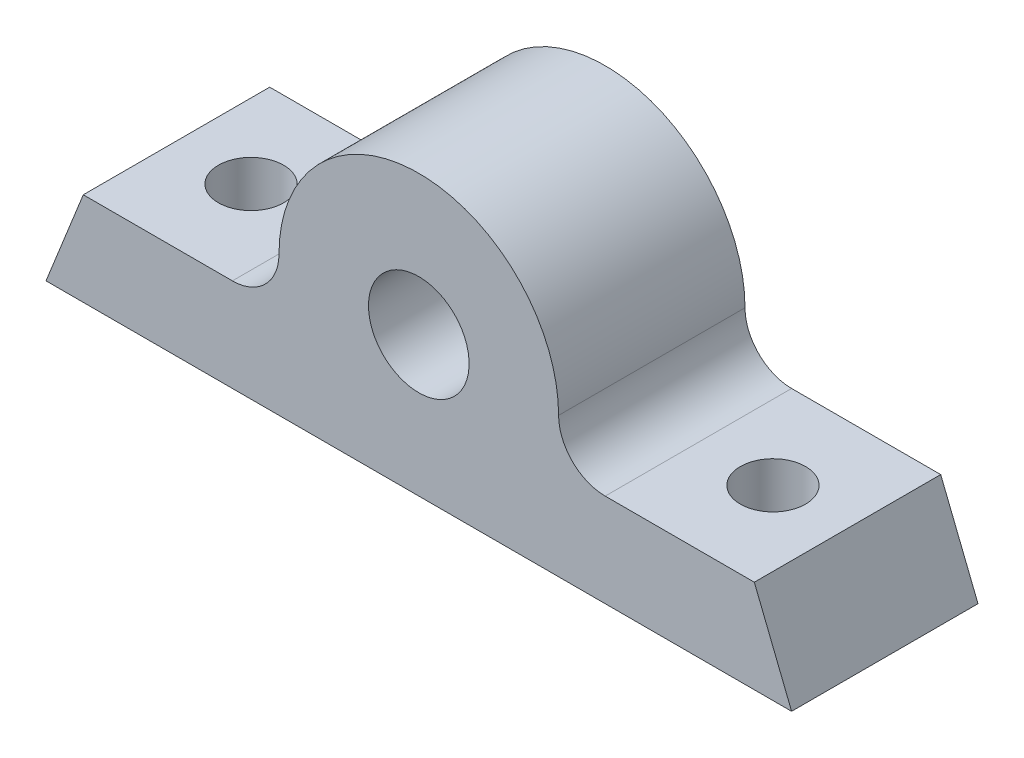
ISO-10303-21;
HEADER;
FILE_DESCRIPTION(('STEP AP214'),'2;1');
FILE_NAME('part.step','',(''),(''),'','','');
FILE_SCHEMA(('AUTOMOTIVE_DESIGN { 1 0 10303 214 1 1 1 1 }'));
ENDSEC;
DATA;
#1=APPLICATION_CONTEXT('core data for automotive mechanical design processes');
#2=APPLICATION_PROTOCOL_DEFINITION('international standard','automotive_design',2000,#1);
#3=PRODUCT_CONTEXT('',#1,'mechanical');
#4=PRODUCT('Part','Part','',(#3));
#5=PRODUCT_RELATED_PRODUCT_CATEGORY('part','',(#4));
#6=PRODUCT_DEFINITION_FORMATION('','',#4);
#7=PRODUCT_DEFINITION_CONTEXT('part definition',#1,'design');
#8=PRODUCT_DEFINITION('design','',#6,#7);
#9=PRODUCT_DEFINITION_SHAPE('','',#8);
#10=(LENGTH_UNIT() NAMED_UNIT(*) SI_UNIT(.MILLI.,.METRE.));
#11=(NAMED_UNIT(*) PLANE_ANGLE_UNIT() SI_UNIT($,.RADIAN.));
#12=(NAMED_UNIT(*) SI_UNIT($,.STERADIAN.) SOLID_ANGLE_UNIT());
#13=UNCERTAINTY_MEASURE_WITH_UNIT(LENGTH_MEASURE(1.E-05),#10,'distance_accuracy_value','');
#14=(GEOMETRIC_REPRESENTATION_CONTEXT(3) GLOBAL_UNCERTAINTY_ASSIGNED_CONTEXT((#13)) GLOBAL_UNIT_ASSIGNED_CONTEXT((#10,
#11,#12)) REPRESENTATION_CONTEXT('',''));
#15=CARTESIAN_POINT('',(0.,0.,0.));
#16=DIRECTION('',(0.,0.,1.));
#17=DIRECTION('',(1.,0.,0.));
#18=AXIS2_PLACEMENT_3D('',#15,#16,#17);
#19=CARTESIAN_POINT('',(-10.,0.,10.));
#20=DIRECTION('',(0.,0.,-1.));
#21=DIRECTION('',(-1.,0.,0.));
#22=AXIS2_PLACEMENT_3D('',#19,#20,#21);
#23=PLANE('',#22);
#24=CARTESIAN_POINT('',(-10.,0.,10.));
#25=DIRECTION('',(0.,0.,-1.));
#26=DIRECTION('',(-1.,0.,0.));
#27=AXIS2_PLACEMENT_3D('',#24,#25,#26);
#28=CIRCLE('',#27,2.5);
#29=CARTESIAN_POINT('',(-7.5,0.,10.));
#30=VERTEX_POINT('',#29);
#31=CARTESIAN_POINT('',(-10.,-2.5,10.));
#32=VERTEX_POINT('',#31);
#33=EDGE_CURVE('E145',#30,#32,#28,.T.);
#34=ORIENTED_EDGE('',*,*,#33,.T.);
#35=DIRECTION('',(-1.,0.,0.));
#36=VECTOR('',#35,1.);
#37=CARTESIAN_POINT('',(-10.,-2.5,10.));
#38=LINE('',#37,#36);
#39=CARTESIAN_POINT('',(-18.,-2.5,10.));
#40=VERTEX_POINT('',#39);
#41=EDGE_CURVE('E93',#32,#40,#38,.T.);
#42=ORIENTED_EDGE('',*,*,#41,.T.);
#43=DIRECTION('',(-0.371390676354104,-0.928476690885259,0.));
#44=VECTOR('',#43,1.);
#45=CARTESIAN_POINT('',(-18.,-2.5,10.));
#46=LINE('',#45,#44);
#47=CARTESIAN_POINT('',(-20.,-7.5,10.));
#48=VERTEX_POINT('',#47);
#49=EDGE_CURVE('E160',#40,#48,#46,.T.);
#50=ORIENTED_EDGE('',*,*,#49,.T.);
#51=DIRECTION('',(1.,0.,0.));
#52=VECTOR('',#51,1.);
#53=CARTESIAN_POINT('',(-20.,-7.5,10.));
#54=LINE('',#53,#52);
#55=CARTESIAN_POINT('',(20.,-7.5,10.));
#56=VERTEX_POINT('',#55);
#57=EDGE_CURVE('E173',#48,#56,#54,.T.);
#58=ORIENTED_EDGE('',*,*,#57,.T.);
#59=DIRECTION('',(-0.371390676354104,0.928476690885259,0.));
#60=VECTOR('',#59,1.);
#61=CARTESIAN_POINT('',(18.,-2.5,10.));
#62=LINE('',#61,#60);
#63=CARTESIAN_POINT('',(18.,-2.5,10.));
#64=VERTEX_POINT('',#63);
#65=EDGE_CURVE('E112',#56,#64,#62,.T.);
#66=ORIENTED_EDGE('',*,*,#65,.T.);
#67=DIRECTION('',(-1.,0.,0.));
#68=VECTOR('',#67,1.);
#69=CARTESIAN_POINT('',(10.,-2.5,10.));
#70=LINE('',#69,#68);
#71=CARTESIAN_POINT('',(10.,-2.5,10.));
#72=VERTEX_POINT('',#71);
#73=EDGE_CURVE('E106',#64,#72,#70,.T.);
#74=ORIENTED_EDGE('',*,*,#73,.T.);
#75=CARTESIAN_POINT('',(10.,0.,10.));
#76=DIRECTION('',(0.,0.,-1.));
#77=DIRECTION('',(1.,0.,0.));
#78=AXIS2_PLACEMENT_3D('',#75,#76,#77);
#79=CIRCLE('',#78,2.5);
#80=CARTESIAN_POINT('',(7.5,0.,10.));
#81=VERTEX_POINT('',#80);
#82=EDGE_CURVE('E110',#72,#81,#79,.T.);
#83=ORIENTED_EDGE('',*,*,#82,.T.);
#84=CARTESIAN_POINT('',(0.,0.,10.));
#85=DIRECTION('',(0.,0.,1.));
#86=DIRECTION('',(-1.,0.,0.));
#87=AXIS2_PLACEMENT_3D('',#84,#85,#86);
#88=CIRCLE('',#87,7.5);
#89=EDGE_CURVE('E50',#81,#30,#88,.T.);
#90=ORIENTED_EDGE('',*,*,#89,.T.);
#91=EDGE_LOOP('',(#34,#42,#50,#58,#66,#74,#83,#90));
#92=FACE_BOUND('',#91,.T.);
#93=CARTESIAN_POINT('',(0.,0.,10.));
#94=DIRECTION('',(0.,0.,-1.));
#95=DIRECTION('',(-1.,0.,0.));
#96=AXIS2_PLACEMENT_3D('',#93,#94,#95);
#97=CIRCLE('',#96,2.7);
#98=CARTESIAN_POINT('',(-2.7,0.,10.));
#99=VERTEX_POINT('',#98);
#100=EDGE_CURVE('E134',#99,#99,#97,.T.);
#101=ORIENTED_EDGE('',*,*,#100,.T.);
#102=EDGE_LOOP('',(#101));
#103=FACE_BOUND('',#102,.T.);
#104=ADVANCED_FACE('F33',(#92,#103),#23,.F.);
#105=CARTESIAN_POINT('',(-10.,0.,0.));
#106=DIRECTION('',(0.,0.,-1.));
#107=DIRECTION('',(-1.,0.,0.));
#108=AXIS2_PLACEMENT_3D('',#105,#106,#107);
#109=PLANE('',#108);
#110=CARTESIAN_POINT('',(-10.,0.,0.));
#111=DIRECTION('',(0.,0.,-1.));
#112=DIRECTION('',(-1.,0.,0.));
#113=AXIS2_PLACEMENT_3D('',#110,#111,#112);
#114=CIRCLE('',#113,2.5);
#115=CARTESIAN_POINT('',(-7.5,0.,0.));
#116=VERTEX_POINT('',#115);
#117=CARTESIAN_POINT('',(-10.,-2.5,0.));
#118=VERTEX_POINT('',#117);
#119=EDGE_CURVE('E130',#116,#118,#114,.T.);
#120=ORIENTED_EDGE('',*,*,#119,.F.);
#121=CARTESIAN_POINT('',(0.,0.,0.));
#122=DIRECTION('',(0.,0.,1.));
#123=DIRECTION('',(-1.,0.,0.));
#124=AXIS2_PLACEMENT_3D('',#121,#122,#123);
#125=CIRCLE('',#124,7.5);
#126=CARTESIAN_POINT('',(7.5,0.,0.));
#127=VERTEX_POINT('',#126);
#128=EDGE_CURVE('E85',#127,#116,#125,.T.);
#129=ORIENTED_EDGE('',*,*,#128,.F.);
#130=CARTESIAN_POINT('',(10.,0.,0.));
#131=DIRECTION('',(0.,0.,-1.));
#132=DIRECTION('',(1.,0.,0.));
#133=AXIS2_PLACEMENT_3D('',#130,#131,#132);
#134=CIRCLE('',#133,2.5);
#135=CARTESIAN_POINT('',(10.,-2.5,0.));
#136=VERTEX_POINT('',#135);
#137=EDGE_CURVE('E79',#136,#127,#134,.T.);
#138=ORIENTED_EDGE('',*,*,#137,.F.);
#139=DIRECTION('',(-1.,0.,0.));
#140=VECTOR('',#139,1.);
#141=CARTESIAN_POINT('',(10.,-2.5,0.));
#142=LINE('',#141,#140);
#143=CARTESIAN_POINT('',(18.,-2.5,0.));
#144=VERTEX_POINT('',#143);
#145=EDGE_CURVE('E120',#144,#136,#142,.T.);
#146=ORIENTED_EDGE('',*,*,#145,.F.);
#147=DIRECTION('',(-0.371390676354104,0.928476690885259,0.));
#148=VECTOR('',#147,1.);
#149=CARTESIAN_POINT('',(18.,-2.5,0.));
#150=LINE('',#149,#148);
#151=CARTESIAN_POINT('',(20.,-7.5,0.));
#152=VERTEX_POINT('',#151);
#153=EDGE_CURVE('E140',#152,#144,#150,.T.);
#154=ORIENTED_EDGE('',*,*,#153,.F.);
#155=DIRECTION('',(1.,0.,0.));
#156=VECTOR('',#155,1.);
#157=CARTESIAN_POINT('',(-20.,-7.5,0.));
#158=LINE('',#157,#156);
#159=CARTESIAN_POINT('',(-20.,-7.5,0.));
#160=VERTEX_POINT('',#159);
#161=EDGE_CURVE('E138',#160,#152,#158,.T.);
#162=ORIENTED_EDGE('',*,*,#161,.F.);
#163=DIRECTION('',(-0.371390676354104,-0.928476690885259,0.));
#164=VECTOR('',#163,1.);
#165=CARTESIAN_POINT('',(-18.,-2.5,0.));
#166=LINE('',#165,#164);
#167=CARTESIAN_POINT('',(-18.,-2.5,0.));
#168=VERTEX_POINT('',#167);
#169=EDGE_CURVE('E136',#168,#160,#166,.T.);
#170=ORIENTED_EDGE('',*,*,#169,.F.);
#171=DIRECTION('',(-1.,0.,0.));
#172=VECTOR('',#171,1.);
#173=CARTESIAN_POINT('',(-10.,-2.5,0.));
#174=LINE('',#173,#172);
#175=EDGE_CURVE('E133',#118,#168,#174,.T.);
#176=ORIENTED_EDGE('',*,*,#175,.F.);
#177=EDGE_LOOP('',(#120,#129,#138,#146,#154,#162,#170,#176));
#178=FACE_BOUND('',#177,.T.);
#179=CARTESIAN_POINT('',(0.,0.,0.));
#180=DIRECTION('',(0.,0.,-1.));
#181=DIRECTION('',(-1.,0.,0.));
#182=AXIS2_PLACEMENT_3D('',#179,#180,#181);
#183=CIRCLE('',#182,4.);
#184=CARTESIAN_POINT('',(-4.,0.,0.));
#185=VERTEX_POINT('',#184);
#186=EDGE_CURVE('E190',#185,#185,#183,.T.);
#187=ORIENTED_EDGE('',*,*,#186,.F.);
#188=EDGE_LOOP('',(#187));
#189=FACE_BOUND('',#188,.T.);
#190=ADVANCED_FACE('F164',(#178,#189),#109,.T.);
#191=CARTESIAN_POINT('',(-10.,0.,10.));
#192=DIRECTION('',(0.,0.,-1.));
#193=DIRECTION('',(-1.,0.,0.));
#194=AXIS2_PLACEMENT_3D('',#191,#192,#193);
#195=CYLINDRICAL_SURFACE('',#194,2.5);
#196=ORIENTED_EDGE('',*,*,#119,.T.);
#197=DIRECTION('',(0.,0.,-1.));
#198=VECTOR('',#197,1.);
#199=CARTESIAN_POINT('',(-10.,-2.5,10.));
#200=LINE('',#199,#198);
#201=EDGE_CURVE('E11',#32,#118,#200,.T.);
#202=ORIENTED_EDGE('',*,*,#201,.F.);
#203=ORIENTED_EDGE('',*,*,#33,.F.);
#204=DIRECTION('',(0.,0.,-1.));
#205=VECTOR('',#204,1.);
#206=CARTESIAN_POINT('',(-7.5,0.,10.));
#207=LINE('',#206,#205);
#208=EDGE_CURVE('E126',#30,#116,#207,.T.);
#209=ORIENTED_EDGE('',*,*,#208,.T.);
#210=EDGE_LOOP('',(#196,#202,#203,#209));
#211=FACE_BOUND('',#210,.T.);
#212=ADVANCED_FACE('F35',(#211),#195,.F.);
#213=CARTESIAN_POINT('',(-10.,-2.5,10.));
#214=DIRECTION('',(0.,-1.,0.));
#215=DIRECTION('',(1.,0.,0.));
#216=AXIS2_PLACEMENT_3D('',#213,#214,#215);
#217=PLANE('',#216);
#218=CARTESIAN_POINT('',(-14.,-2.5,5.));
#219=DIRECTION('',(0.,1.,0.));
#220=DIRECTION('',(-1.,0.,0.));
#221=AXIS2_PLACEMENT_3D('',#218,#219,#220);
#222=CIRCLE('',#221,1.75);
#223=CARTESIAN_POINT('',(-15.75,-2.5,5.));
#224=VERTEX_POINT('',#223);
#225=EDGE_CURVE('E194',#224,#224,#222,.T.);
#226=ORIENTED_EDGE('',*,*,#225,.F.);
#227=EDGE_LOOP('',(#226));
#228=FACE_BOUND('',#227,.T.);
#229=ORIENTED_EDGE('',*,*,#175,.T.);
#230=DIRECTION('',(0.,0.,-1.));
#231=VECTOR('',#230,1.);
#232=CARTESIAN_POINT('',(-18.,-2.5,10.));
#233=LINE('',#232,#231);
#234=EDGE_CURVE('E42',#40,#168,#233,.T.);
#235=ORIENTED_EDGE('',*,*,#234,.F.);
#236=ORIENTED_EDGE('',*,*,#41,.F.);
#237=ORIENTED_EDGE('',*,*,#201,.T.);
#238=EDGE_LOOP('',(#229,#235,#236,#237));
#239=FACE_BOUND('',#238,.T.);
#240=ADVANCED_FACE('F273',(#228,#239),#217,.F.);
#241=CARTESIAN_POINT('',(-18.,-2.5,10.));
#242=DIRECTION('',(0.928476690885259,-0.371390676354104,0.));
#243=DIRECTION('',(0.371390676354104,0.928476690885259,0.));
#244=AXIS2_PLACEMENT_3D('',#241,#242,#243);
#245=PLANE('',#244);
#246=ORIENTED_EDGE('',*,*,#169,.T.);
#247=DIRECTION('',(0.,0.,-1.));
#248=VECTOR('',#247,1.);
#249=CARTESIAN_POINT('',(-20.,-7.5,10.));
#250=LINE('',#249,#248);
#251=EDGE_CURVE('E152',#48,#160,#250,.T.);
#252=ORIENTED_EDGE('',*,*,#251,.F.);
#253=ORIENTED_EDGE('',*,*,#49,.F.);
#254=ORIENTED_EDGE('',*,*,#234,.T.);
#255=EDGE_LOOP('',(#246,#252,#253,#254));
#256=FACE_BOUND('',#255,.T.);
#257=ADVANCED_FACE('F158',(#256),#245,.F.);
#258=CARTESIAN_POINT('',(-20.,-7.5,10.));
#259=DIRECTION('',(0.,1.,0.));
#260=DIRECTION('',(0.,0.,1.));
#261=AXIS2_PLACEMENT_3D('',#258,#259,#260);
#262=PLANE('',#261);
#263=CARTESIAN_POINT('',(14.,-7.5,5.));
#264=DIRECTION('',(0.,1.,0.));
#265=DIRECTION('',(-1.,0.,0.));
#266=AXIS2_PLACEMENT_3D('',#263,#264,#265);
#267=CIRCLE('',#266,1.75);
#268=CARTESIAN_POINT('',(12.25,-7.5,5.));
#269=VERTEX_POINT('',#268);
#270=EDGE_CURVE('E197',#269,#269,#267,.T.);
#271=ORIENTED_EDGE('',*,*,#270,.T.);
#272=EDGE_LOOP('',(#271));
#273=FACE_BOUND('',#272,.T.);
#274=CARTESIAN_POINT('',(-14.,-7.50000000000001,5.));
#275=DIRECTION('',(0.,1.,0.));
#276=DIRECTION('',(-1.,0.,0.));
#277=AXIS2_PLACEMENT_3D('',#274,#275,#276);
#278=CIRCLE('',#277,1.75);
#279=CARTESIAN_POINT('',(-15.75,-7.50000000000001,5.));
#280=VERTEX_POINT('',#279);
#281=EDGE_CURVE('E193',#280,#280,#278,.T.);
#282=ORIENTED_EDGE('',*,*,#281,.T.);
#283=EDGE_LOOP('',(#282));
#284=FACE_BOUND('',#283,.T.);
#285=ORIENTED_EDGE('',*,*,#161,.T.);
#286=DIRECTION('',(0.,0.,-1.));
#287=VECTOR('',#286,1.);
#288=CARTESIAN_POINT('',(20.,-7.5,10.));
#289=LINE('',#288,#287);
#290=EDGE_CURVE('E149',#56,#152,#289,.T.);
#291=ORIENTED_EDGE('',*,*,#290,.F.);
#292=ORIENTED_EDGE('',*,*,#57,.F.);
#293=ORIENTED_EDGE('',*,*,#251,.T.);
#294=EDGE_LOOP('',(#285,#291,#292,#293));
#295=FACE_BOUND('',#294,.T.);
#296=ADVANCED_FACE('F169',(#273,#284,#295),#262,.F.);
#297=CARTESIAN_POINT('',(18.,-2.5,10.));
#298=DIRECTION('',(-0.928476690885259,-0.371390676354104,0.));
#299=DIRECTION('',(0.371390676354104,-0.928476690885259,0.));
#300=AXIS2_PLACEMENT_3D('',#297,#298,#299);
#301=PLANE('',#300);
#302=ORIENTED_EDGE('',*,*,#153,.T.);
#303=DIRECTION('',(0.,0.,-1.));
#304=VECTOR('',#303,1.);
#305=CARTESIAN_POINT('',(18.,-2.5,10.));
#306=LINE('',#305,#304);
#307=EDGE_CURVE('E121',#64,#144,#306,.T.);
#308=ORIENTED_EDGE('',*,*,#307,.F.);
#309=ORIENTED_EDGE('',*,*,#65,.F.);
#310=ORIENTED_EDGE('',*,*,#290,.T.);
#311=EDGE_LOOP('',(#302,#308,#309,#310));
#312=FACE_BOUND('',#311,.T.);
#313=ADVANCED_FACE('F172',(#312),#301,.F.);
#314=CARTESIAN_POINT('',(10.,-2.5,10.));
#315=DIRECTION('',(0.,-1.,0.));
#316=DIRECTION('',(1.,0.,0.));
#317=AXIS2_PLACEMENT_3D('',#314,#315,#316);
#318=PLANE('',#317);
#319=CARTESIAN_POINT('',(14.,-2.5,5.));
#320=DIRECTION('',(0.,1.,0.));
#321=DIRECTION('',(-1.,0.,0.));
#322=AXIS2_PLACEMENT_3D('',#319,#320,#321);
#323=CIRCLE('',#322,1.75);
#324=CARTESIAN_POINT('',(12.25,-2.5,5.));
#325=VERTEX_POINT('',#324);
#326=EDGE_CURVE('E200',#325,#325,#323,.T.);
#327=ORIENTED_EDGE('',*,*,#326,.F.);
#328=EDGE_LOOP('',(#327));
#329=FACE_BOUND('',#328,.T.);
#330=ORIENTED_EDGE('',*,*,#145,.T.);
#331=DIRECTION('',(0.,0.,-1.));
#332=VECTOR('',#331,1.);
#333=CARTESIAN_POINT('',(10.,-2.5,10.));
#334=LINE('',#333,#332);
#335=EDGE_CURVE('E117',#72,#136,#334,.T.);
#336=ORIENTED_EDGE('',*,*,#335,.F.);
#337=ORIENTED_EDGE('',*,*,#73,.F.);
#338=ORIENTED_EDGE('',*,*,#307,.T.);
#339=EDGE_LOOP('',(#330,#336,#337,#338));
#340=FACE_BOUND('',#339,.T.);
#341=ADVANCED_FACE('F118',(#329,#340),#318,.F.);
#342=CARTESIAN_POINT('',(10.,0.,10.));
#343=DIRECTION('',(0.,0.,-1.));
#344=DIRECTION('',(-1.,0.,0.));
#345=AXIS2_PLACEMENT_3D('',#342,#343,#344);
#346=CYLINDRICAL_SURFACE('',#345,2.5);
#347=ORIENTED_EDGE('',*,*,#137,.T.);
#348=DIRECTION('',(0.,0.,-1.));
#349=VECTOR('',#348,1.);
#350=CARTESIAN_POINT('',(7.5,0.,10.));
#351=LINE('',#350,#349);
#352=EDGE_CURVE('E122',#81,#127,#351,.T.);
#353=ORIENTED_EDGE('',*,*,#352,.F.);
#354=ORIENTED_EDGE('',*,*,#82,.F.);
#355=ORIENTED_EDGE('',*,*,#335,.T.);
#356=EDGE_LOOP('',(#347,#353,#354,#355));
#357=FACE_BOUND('',#356,.T.);
#358=ADVANCED_FACE('F124',(#357),#346,.F.);
#359=CARTESIAN_POINT('',(0.,0.,10.));
#360=DIRECTION('',(0.,0.,-1.));
#361=DIRECTION('',(-1.,0.,0.));
#362=AXIS2_PLACEMENT_3D('',#359,#360,#361);
#363=CYLINDRICAL_SURFACE('',#362,7.5);
#364=ORIENTED_EDGE('',*,*,#128,.T.);
#365=ORIENTED_EDGE('',*,*,#208,.F.);
#366=ORIENTED_EDGE('',*,*,#89,.F.);
#367=ORIENTED_EDGE('',*,*,#352,.T.);
#368=EDGE_LOOP('',(#364,#365,#366,#367));
#369=FACE_BOUND('',#368,.T.);
#370=ADVANCED_FACE('F221',(#369),#363,.T.);
#371=CARTESIAN_POINT('',(0.,0.,3.125));
#372=DIRECTION('',(0.,0.,-1.));
#373=DIRECTION('',(-1.,0.,0.));
#374=AXIS2_PLACEMENT_3D('',#371,#372,#373);
#375=CONICAL_SURFACE('',#374,1.5,0.674740942223553);
#376=ORIENTED_EDGE('',*,*,#186,.T.);
#377=EDGE_LOOP('',(#376));
#378=FACE_BOUND('',#377,.T.);
#379=CARTESIAN_POINT('',(0.,0.,3.125));
#380=DIRECTION('',(0.,0.,-1.));
#381=DIRECTION('',(-1.,0.,0.));
#382=AXIS2_PLACEMENT_3D('',#379,#380,#381);
#383=CIRCLE('',#382,1.5);
#384=CARTESIAN_POINT('',(-1.5,0.,3.125));
#385=VERTEX_POINT('',#384);
#386=EDGE_CURVE('E187',#385,#385,#383,.T.);
#387=ORIENTED_EDGE('',*,*,#386,.F.);
#388=EDGE_LOOP('',(#387));
#389=FACE_BOUND('',#388,.T.);
#390=ADVANCED_FACE('F235',(#378,#389),#375,.F.);
#391=CARTESIAN_POINT('',(0.,0.,0.));
#392=DIRECTION('',(0.,0.,-1.));
#393=DIRECTION('',(-1.,0.,0.));
#394=AXIS2_PLACEMENT_3D('',#391,#392,#393);
#395=CYLINDRICAL_SURFACE('',#394,2.7);
#396=CARTESIAN_POINT('',(0.,0.,5.));
#397=DIRECTION('',(0.,0.,-1.));
#398=DIRECTION('',(-1.,0.,0.));
#399=AXIS2_PLACEMENT_3D('',#396,#397,#398);
#400=CIRCLE('',#399,2.7);
#401=CARTESIAN_POINT('',(-2.7,0.,5.));
#402=VERTEX_POINT('',#401);
#403=EDGE_CURVE('E181',#402,#402,#400,.T.);
#404=ORIENTED_EDGE('',*,*,#403,.T.);
#405=EDGE_LOOP('',(#404));
#406=FACE_BOUND('',#405,.T.);
#407=ORIENTED_EDGE('',*,*,#100,.F.);
#408=EDGE_LOOP('',(#407));
#409=FACE_BOUND('',#408,.T.);
#410=ADVANCED_FACE('F239',(#406,#409),#395,.F.);
#411=CARTESIAN_POINT('',(0.,0.,5.));
#412=DIRECTION('',(0.,0.,1.));
#413=DIRECTION('',(1.,0.,0.));
#414=AXIS2_PLACEMENT_3D('',#411,#412,#413);
#415=PLANE('',#414);
#416=CARTESIAN_POINT('',(0.,0.,5.));
#417=DIRECTION('',(0.,0.,-1.));
#418=DIRECTION('',(-1.,0.,0.));
#419=AXIS2_PLACEMENT_3D('',#416,#417,#418);
#420=CIRCLE('',#419,1.5);
#421=CARTESIAN_POINT('',(-1.5,0.,5.));
#422=VERTEX_POINT('',#421);
#423=EDGE_CURVE('E184',#422,#422,#420,.T.);
#424=ORIENTED_EDGE('',*,*,#423,.T.);
#425=EDGE_LOOP('',(#424));
#426=FACE_BOUND('',#425,.T.);
#427=ORIENTED_EDGE('',*,*,#403,.F.);
#428=EDGE_LOOP('',(#427));
#429=FACE_BOUND('',#428,.T.);
#430=ADVANCED_FACE('F245',(#426,#429),#415,.T.);
#431=CARTESIAN_POINT('',(0.,0.,10.));
#432=DIRECTION('',(0.,0.,-1.));
#433=DIRECTION('',(-1.,0.,0.));
#434=AXIS2_PLACEMENT_3D('',#431,#432,#433);
#435=CYLINDRICAL_SURFACE('',#434,1.5);
#436=ORIENTED_EDGE('',*,*,#386,.T.);
#437=EDGE_LOOP('',(#436));
#438=FACE_BOUND('',#437,.T.);
#439=ORIENTED_EDGE('',*,*,#423,.F.);
#440=EDGE_LOOP('',(#439));
#441=FACE_BOUND('',#440,.T.);
#442=ADVANCED_FACE('F231',(#438,#441),#435,.F.);
#443=CARTESIAN_POINT('',(-14.,-7.50000000000001,5.));
#444=DIRECTION('',(0.,1.,0.));
#445=DIRECTION('',(-1.,0.,0.));
#446=AXIS2_PLACEMENT_3D('',#443,#444,#445);
#447=CYLINDRICAL_SURFACE('',#446,1.75);
#448=ORIENTED_EDGE('',*,*,#281,.F.);
#449=EDGE_LOOP('',(#448));
#450=FACE_BOUND('',#449,.T.);
#451=ORIENTED_EDGE('',*,*,#225,.T.);
#452=EDGE_LOOP('',(#451));
#453=FACE_BOUND('',#452,.T.);
#454=ADVANCED_FACE('F211',(#450,#453),#447,.F.);
#455=CARTESIAN_POINT('',(14.,-7.5,5.));
#456=DIRECTION('',(0.,1.,0.));
#457=DIRECTION('',(-1.,0.,0.));
#458=AXIS2_PLACEMENT_3D('',#455,#456,#457);
#459=CYLINDRICAL_SURFACE('',#458,1.75);
#460=ORIENTED_EDGE('',*,*,#270,.F.);
#461=EDGE_LOOP('',(#460));
#462=FACE_BOUND('',#461,.T.);
#463=ORIENTED_EDGE('',*,*,#326,.T.);
#464=EDGE_LOOP('',(#463));
#465=FACE_BOUND('',#464,.T.);
#466=ADVANCED_FACE('F208',(#462,#465),#459,.F.);
#467=CLOSED_SHELL('',(#104,#190,#212,#240,#257,#296,#313,#341,#358,#370,#390,#410,#430,#442,
#454,#466));
#468=MANIFOLD_SOLID_BREP('B2',#467);
#469=ADVANCED_BREP_SHAPE_REPRESENTATION('',(#18,#468),#14);
#470=SHAPE_DEFINITION_REPRESENTATION(#9,#469);
ENDSEC;
END-ISO-10303-21;
